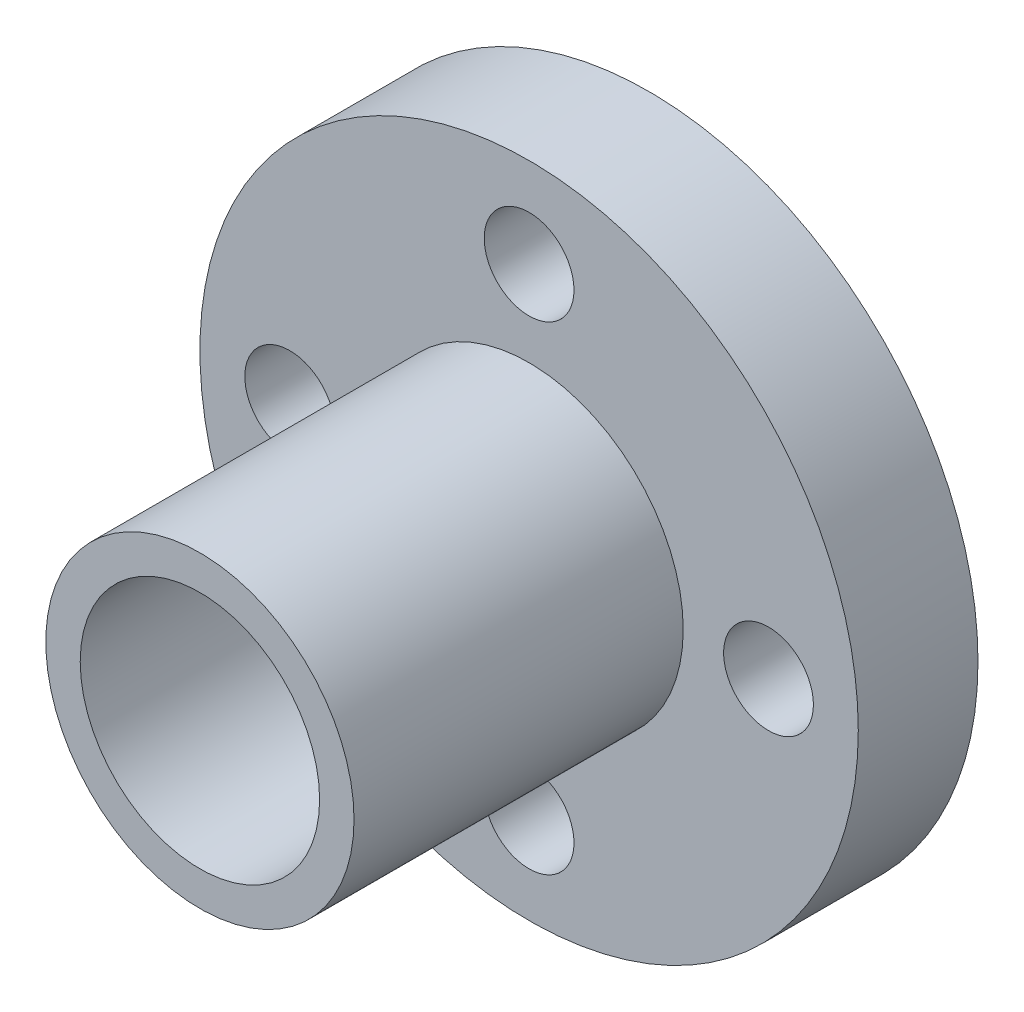
ISO-10303-21;
HEADER;
FILE_DESCRIPTION(('STEP AP214'),'2;1');
FILE_NAME('part.step','',(''),(''),'','','');
FILE_SCHEMA(('AUTOMOTIVE_DESIGN { 1 0 10303 214 1 1 1 1 }'));
ENDSEC;
DATA;
#1=APPLICATION_CONTEXT('core data for automotive mechanical design processes');
#2=APPLICATION_PROTOCOL_DEFINITION('international standard','automotive_design',2000,#1);
#3=PRODUCT_CONTEXT('',#1,'mechanical');
#4=PRODUCT('Part','Part','',(#3));
#5=PRODUCT_RELATED_PRODUCT_CATEGORY('part','',(#4));
#6=PRODUCT_DEFINITION_FORMATION('','',#4);
#7=PRODUCT_DEFINITION_CONTEXT('part definition',#1,'design');
#8=PRODUCT_DEFINITION('design','',#6,#7);
#9=PRODUCT_DEFINITION_SHAPE('','',#8);
#10=(LENGTH_UNIT() NAMED_UNIT(*) SI_UNIT(.MILLI.,.METRE.));
#11=(NAMED_UNIT(*) PLANE_ANGLE_UNIT() SI_UNIT($,.RADIAN.));
#12=(NAMED_UNIT(*) SI_UNIT($,.STERADIAN.) SOLID_ANGLE_UNIT());
#13=UNCERTAINTY_MEASURE_WITH_UNIT(LENGTH_MEASURE(1.E-05),#10,'distance_accuracy_value','');
#14=(GEOMETRIC_REPRESENTATION_CONTEXT(3) GLOBAL_UNCERTAINTY_ASSIGNED_CONTEXT((#13)) GLOBAL_UNIT_ASSIGNED_CONTEXT((#10,
#11,#12)) REPRESENTATION_CONTEXT('',''));
#15=CARTESIAN_POINT('',(0.,0.,0.));
#16=DIRECTION('',(0.,0.,1.));
#17=DIRECTION('',(1.,0.,0.));
#18=AXIS2_PLACEMENT_3D('',#15,#16,#17);
#19=CARTESIAN_POINT('',(0.,0.,4.));
#20=DIRECTION('',(0.,0.,-1.));
#21=DIRECTION('',(-1.,0.,0.));
#22=AXIS2_PLACEMENT_3D('',#19,#20,#21);
#23=CYLINDRICAL_SURFACE('',#22,11.);
#24=CARTESIAN_POINT('',(0.,0.,4.));
#25=DIRECTION('',(0.,0.,1.));
#26=DIRECTION('',(1.,0.,0.));
#27=AXIS2_PLACEMENT_3D('',#24,#25,#26);
#28=CIRCLE('',#27,11.);
#29=CARTESIAN_POINT('',(11.,0.,4.));
#30=VERTEX_POINT('',#29);
#31=EDGE_CURVE('E51',#30,#30,#28,.T.);
#32=ORIENTED_EDGE('',*,*,#31,.F.);
#33=EDGE_LOOP('',(#32));
#34=FACE_BOUND('',#33,.T.);
#35=CARTESIAN_POINT('',(0.,0.,0.));
#36=DIRECTION('',(0.,0.,1.));
#37=DIRECTION('',(1.,0.,0.));
#38=AXIS2_PLACEMENT_3D('',#35,#36,#37);
#39=CIRCLE('',#38,11.);
#40=CARTESIAN_POINT('',(11.,0.,0.));
#41=VERTEX_POINT('',#40);
#42=EDGE_CURVE('E47',#41,#41,#39,.T.);
#43=ORIENTED_EDGE('',*,*,#42,.T.);
#44=EDGE_LOOP('',(#43));
#45=FACE_BOUND('',#44,.T.);
#46=ADVANCED_FACE('F44',(#34,#45),#23,.T.);
#47=CARTESIAN_POINT('',(0.,0.,4.));
#48=DIRECTION('',(0.,0.,1.));
#49=DIRECTION('',(1.,0.,0.));
#50=AXIS2_PLACEMENT_3D('',#47,#48,#49);
#51=PLANE('',#50);
#52=CARTESIAN_POINT('',(0.,8.,4.));
#53=DIRECTION('',(0.,0.,1.));
#54=DIRECTION('',(1.,0.,0.));
#55=AXIS2_PLACEMENT_3D('',#52,#53,#54);
#56=CIRCLE('',#55,1.5);
#57=CARTESIAN_POINT('',(1.5,8.,4.));
#58=VERTEX_POINT('',#57);
#59=EDGE_CURVE('E85',#58,#58,#56,.T.);
#60=ORIENTED_EDGE('',*,*,#59,.F.);
#61=EDGE_LOOP('',(#60));
#62=FACE_BOUND('',#61,.T.);
#63=CARTESIAN_POINT('',(8.,0.,4.));
#64=DIRECTION('',(0.,0.,1.));
#65=DIRECTION('',(1.,0.,0.));
#66=AXIS2_PLACEMENT_3D('',#63,#64,#65);
#67=CIRCLE('',#66,1.5);
#68=CARTESIAN_POINT('',(9.5,0.,4.));
#69=VERTEX_POINT('',#68);
#70=EDGE_CURVE('E79',#69,#69,#67,.T.);
#71=ORIENTED_EDGE('',*,*,#70,.F.);
#72=EDGE_LOOP('',(#71));
#73=FACE_BOUND('',#72,.T.);
#74=CARTESIAN_POINT('',(0.,-8.,4.));
#75=DIRECTION('',(0.,0.,1.));
#76=DIRECTION('',(1.,0.,0.));
#77=AXIS2_PLACEMENT_3D('',#74,#75,#76);
#78=CIRCLE('',#77,1.5);
#79=CARTESIAN_POINT('',(1.49999999999994,-8.,4.));
#80=VERTEX_POINT('',#79);
#81=EDGE_CURVE('E73',#80,#80,#78,.T.);
#82=ORIENTED_EDGE('',*,*,#81,.F.);
#83=EDGE_LOOP('',(#82));
#84=FACE_BOUND('',#83,.T.);
#85=CARTESIAN_POINT('',(-8.,0.,4.));
#86=DIRECTION('',(0.,0.,1.));
#87=DIRECTION('',(1.,0.,0.));
#88=AXIS2_PLACEMENT_3D('',#85,#86,#87);
#89=CIRCLE('',#88,1.5);
#90=CARTESIAN_POINT('',(-6.5,0.,4.));
#91=VERTEX_POINT('',#90);
#92=EDGE_CURVE('E67',#91,#91,#89,.T.);
#93=ORIENTED_EDGE('',*,*,#92,.F.);
#94=EDGE_LOOP('',(#93));
#95=FACE_BOUND('',#94,.T.);
#96=CARTESIAN_POINT('',(0.,0.,4.));
#97=DIRECTION('',(0.,0.,1.));
#98=DIRECTION('',(1.,0.,0.));
#99=AXIS2_PLACEMENT_3D('',#96,#97,#98);
#100=CIRCLE('',#99,5.15);
#101=CARTESIAN_POINT('',(5.15,0.,4.));
#102=VERTEX_POINT('',#101);
#103=EDGE_CURVE('E12',#102,#102,#100,.T.);
#104=ORIENTED_EDGE('',*,*,#103,.F.);
#105=EDGE_LOOP('',(#104));
#106=FACE_BOUND('',#105,.T.);
#107=ORIENTED_EDGE('',*,*,#31,.T.);
#108=EDGE_LOOP('',(#107));
#109=FACE_BOUND('',#108,.T.);
#110=ADVANCED_FACE('F101',(#62,#73,#84,#95,#106,#109),#51,.T.);
#111=CARTESIAN_POINT('',(0.,0.,0.));
#112=DIRECTION('',(0.,0.,1.));
#113=DIRECTION('',(1.,0.,0.));
#114=AXIS2_PLACEMENT_3D('',#111,#112,#113);
#115=PLANE('',#114);
#116=CARTESIAN_POINT('',(0.,8.,0.));
#117=DIRECTION('',(0.,0.,1.));
#118=DIRECTION('',(1.,0.,0.));
#119=AXIS2_PLACEMENT_3D('',#116,#117,#118);
#120=CIRCLE('',#119,1.5);
#121=CARTESIAN_POINT('',(1.5,8.,0.));
#122=VERTEX_POINT('',#121);
#123=EDGE_CURVE('E64',#122,#122,#120,.T.);
#124=ORIENTED_EDGE('',*,*,#123,.T.);
#125=EDGE_LOOP('',(#124));
#126=FACE_BOUND('',#125,.T.);
#127=CARTESIAN_POINT('',(8.,0.,0.));
#128=DIRECTION('',(0.,0.,1.));
#129=DIRECTION('',(1.,0.,0.));
#130=AXIS2_PLACEMENT_3D('',#127,#128,#129);
#131=CIRCLE('',#130,1.5);
#132=CARTESIAN_POINT('',(9.5,0.,0.));
#133=VERTEX_POINT('',#132);
#134=EDGE_CURVE('E82',#133,#133,#131,.T.);
#135=ORIENTED_EDGE('',*,*,#134,.T.);
#136=EDGE_LOOP('',(#135));
#137=FACE_BOUND('',#136,.T.);
#138=CARTESIAN_POINT('',(0.,-8.,0.));
#139=DIRECTION('',(0.,0.,1.));
#140=DIRECTION('',(1.,0.,0.));
#141=AXIS2_PLACEMENT_3D('',#138,#139,#140);
#142=CIRCLE('',#141,1.5);
#143=CARTESIAN_POINT('',(1.49999999999994,-8.,0.));
#144=VERTEX_POINT('',#143);
#145=EDGE_CURVE('E76',#144,#144,#142,.T.);
#146=ORIENTED_EDGE('',*,*,#145,.T.);
#147=EDGE_LOOP('',(#146));
#148=FACE_BOUND('',#147,.T.);
#149=CARTESIAN_POINT('',(-8.,0.,0.));
#150=DIRECTION('',(0.,0.,1.));
#151=DIRECTION('',(1.,0.,0.));
#152=AXIS2_PLACEMENT_3D('',#149,#150,#151);
#153=CIRCLE('',#152,1.5);
#154=CARTESIAN_POINT('',(-6.5,0.,0.));
#155=VERTEX_POINT('',#154);
#156=EDGE_CURVE('E70',#155,#155,#153,.T.);
#157=ORIENTED_EDGE('',*,*,#156,.T.);
#158=EDGE_LOOP('',(#157));
#159=FACE_BOUND('',#158,.T.);
#160=CARTESIAN_POINT('',(0.,0.,0.));
#161=DIRECTION('',(0.,0.,1.));
#162=DIRECTION('',(1.,0.,0.));
#163=AXIS2_PLACEMENT_3D('',#160,#161,#162);
#164=CIRCLE('',#163,4.);
#165=CARTESIAN_POINT('',(4.,0.,0.));
#166=VERTEX_POINT('',#165);
#167=EDGE_CURVE('E60',#166,#166,#164,.T.);
#168=ORIENTED_EDGE('',*,*,#167,.T.);
#169=EDGE_LOOP('',(#168));
#170=FACE_BOUND('',#169,.T.);
#171=ORIENTED_EDGE('',*,*,#42,.F.);
#172=EDGE_LOOP('',(#171));
#173=FACE_BOUND('',#172,.T.);
#174=ADVANCED_FACE('F91',(#126,#137,#148,#159,#170,#173),#115,.F.);
#175=CARTESIAN_POINT('',(0.,0.,15.));
#176=DIRECTION('',(0.,0.,-1.));
#177=DIRECTION('',(-1.,0.,0.));
#178=AXIS2_PLACEMENT_3D('',#175,#176,#177);
#179=CYLINDRICAL_SURFACE('',#178,5.15);
#180=CARTESIAN_POINT('',(0.,0.,15.));
#181=DIRECTION('',(0.,0.,1.));
#182=DIRECTION('',(1.,0.,0.));
#183=AXIS2_PLACEMENT_3D('',#180,#181,#182);
#184=CIRCLE('',#183,5.15);
#185=CARTESIAN_POINT('',(5.15,0.,15.));
#186=VERTEX_POINT('',#185);
#187=EDGE_CURVE('E57',#186,#186,#184,.T.);
#188=ORIENTED_EDGE('',*,*,#187,.F.);
#189=EDGE_LOOP('',(#188));
#190=FACE_BOUND('',#189,.T.);
#191=ORIENTED_EDGE('',*,*,#103,.T.);
#192=EDGE_LOOP('',(#191));
#193=FACE_BOUND('',#192,.T.);
#194=ADVANCED_FACE('F120',(#190,#193),#179,.T.);
#195=CARTESIAN_POINT('',(0.,0.,15.));
#196=DIRECTION('',(0.,0.,1.));
#197=DIRECTION('',(1.,0.,0.));
#198=AXIS2_PLACEMENT_3D('',#195,#196,#197);
#199=PLANE('',#198);
#200=CARTESIAN_POINT('',(0.,0.,15.));
#201=DIRECTION('',(0.,0.,1.));
#202=DIRECTION('',(1.,0.,0.));
#203=AXIS2_PLACEMENT_3D('',#200,#201,#202);
#204=CIRCLE('',#203,4.);
#205=CARTESIAN_POINT('',(4.,0.,15.));
#206=VERTEX_POINT('',#205);
#207=EDGE_CURVE('E61',#206,#206,#204,.T.);
#208=ORIENTED_EDGE('',*,*,#207,.F.);
#209=EDGE_LOOP('',(#208));
#210=FACE_BOUND('',#209,.T.);
#211=ORIENTED_EDGE('',*,*,#187,.T.);
#212=EDGE_LOOP('',(#211));
#213=FACE_BOUND('',#212,.T.);
#214=ADVANCED_FACE('F124',(#210,#213),#199,.T.);
#215=CARTESIAN_POINT('',(0.,0.,0.));
#216=DIRECTION('',(0.,0.,1.));
#217=DIRECTION('',(1.,0.,0.));
#218=AXIS2_PLACEMENT_3D('',#215,#216,#217);
#219=CYLINDRICAL_SURFACE('',#218,4.);
#220=ORIENTED_EDGE('',*,*,#167,.F.);
#221=EDGE_LOOP('',(#220));
#222=FACE_BOUND('',#221,.T.);
#223=ORIENTED_EDGE('',*,*,#207,.T.);
#224=EDGE_LOOP('',(#223));
#225=FACE_BOUND('',#224,.T.);
#226=ADVANCED_FACE('F130',(#222,#225),#219,.F.);
#227=CARTESIAN_POINT('',(-8.,0.,0.));
#228=DIRECTION('',(0.,0.,1.));
#229=DIRECTION('',(1.,0.,0.));
#230=AXIS2_PLACEMENT_3D('',#227,#228,#229);
#231=CYLINDRICAL_SURFACE('',#230,1.5);
#232=ORIENTED_EDGE('',*,*,#156,.F.);
#233=EDGE_LOOP('',(#232));
#234=FACE_BOUND('',#233,.T.);
#235=ORIENTED_EDGE('',*,*,#92,.T.);
#236=EDGE_LOOP('',(#235));
#237=FACE_BOUND('',#236,.T.);
#238=ADVANCED_FACE('F134',(#234,#237),#231,.F.);
#239=CARTESIAN_POINT('',(0.,-8.,0.));
#240=DIRECTION('',(0.,0.,1.));
#241=DIRECTION('',(1.,0.,0.));
#242=AXIS2_PLACEMENT_3D('',#239,#240,#241);
#243=CYLINDRICAL_SURFACE('',#242,1.5);
#244=ORIENTED_EDGE('',*,*,#145,.F.);
#245=EDGE_LOOP('',(#244));
#246=FACE_BOUND('',#245,.T.);
#247=ORIENTED_EDGE('',*,*,#81,.T.);
#248=EDGE_LOOP('',(#247));
#249=FACE_BOUND('',#248,.T.);
#250=ADVANCED_FACE('F138',(#246,#249),#243,.F.);
#251=CARTESIAN_POINT('',(8.,0.,0.));
#252=DIRECTION('',(0.,0.,1.));
#253=DIRECTION('',(1.,0.,0.));
#254=AXIS2_PLACEMENT_3D('',#251,#252,#253);
#255=CYLINDRICAL_SURFACE('',#254,1.5);
#256=ORIENTED_EDGE('',*,*,#134,.F.);
#257=EDGE_LOOP('',(#256));
#258=FACE_BOUND('',#257,.T.);
#259=ORIENTED_EDGE('',*,*,#70,.T.);
#260=EDGE_LOOP('',(#259));
#261=FACE_BOUND('',#260,.T.);
#262=ADVANCED_FACE('F97',(#258,#261),#255,.F.);
#263=CARTESIAN_POINT('',(0.,8.,0.));
#264=DIRECTION('',(0.,0.,1.));
#265=DIRECTION('',(1.,0.,0.));
#266=AXIS2_PLACEMENT_3D('',#263,#264,#265);
#267=CYLINDRICAL_SURFACE('',#266,1.5);
#268=ORIENTED_EDGE('',*,*,#123,.F.);
#269=EDGE_LOOP('',(#268));
#270=FACE_BOUND('',#269,.T.);
#271=ORIENTED_EDGE('',*,*,#59,.T.);
#272=EDGE_LOOP('',(#271));
#273=FACE_BOUND('',#272,.T.);
#274=ADVANCED_FACE('F94',(#270,#273),#267,.F.);
#275=CLOSED_SHELL('',(#46,#110,#174,#194,#214,#226,#238,#250,#262,#274));
#276=MANIFOLD_SOLID_BREP('B2',#275);
#277=ADVANCED_BREP_SHAPE_REPRESENTATION('',(#18,#276),#14);
#278=SHAPE_DEFINITION_REPRESENTATION(#9,#277);
ENDSEC;
END-ISO-10303-21;
